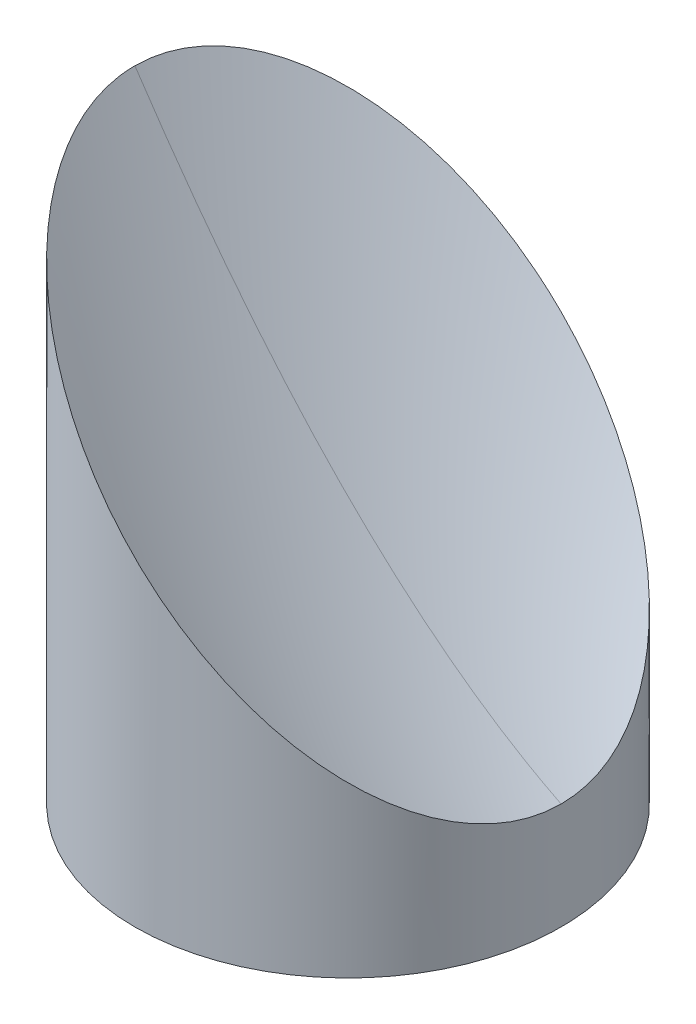
ISO-10303-21;
HEADER;
FILE_DESCRIPTION(('STEP AP214'),'2;1');
FILE_NAME('part.step','',(''),(''),'','','');
FILE_SCHEMA(('AUTOMOTIVE_DESIGN { 1 0 10303 214 1 1 1 1 }'));
ENDSEC;
DATA;
#1=APPLICATION_CONTEXT('core data for automotive mechanical design processes');
#2=APPLICATION_PROTOCOL_DEFINITION('international standard','automotive_design',2000,#1);
#3=PRODUCT_CONTEXT('',#1,'mechanical');
#4=PRODUCT('Part','Part','',(#3));
#5=PRODUCT_RELATED_PRODUCT_CATEGORY('part','',(#4));
#6=PRODUCT_DEFINITION_FORMATION('','',#4);
#7=PRODUCT_DEFINITION_CONTEXT('part definition',#1,'design');
#8=PRODUCT_DEFINITION('design','',#6,#7);
#9=PRODUCT_DEFINITION_SHAPE('','',#8);
#10=(LENGTH_UNIT() NAMED_UNIT(*) SI_UNIT(.MILLI.,.METRE.));
#11=(NAMED_UNIT(*) PLANE_ANGLE_UNIT() SI_UNIT($,.RADIAN.));
#12=(NAMED_UNIT(*) SI_UNIT($,.STERADIAN.) SOLID_ANGLE_UNIT());
#13=UNCERTAINTY_MEASURE_WITH_UNIT(LENGTH_MEASURE(1.E-05),#10,'distance_accuracy_value','');
#14=(GEOMETRIC_REPRESENTATION_CONTEXT(3) GLOBAL_UNCERTAINTY_ASSIGNED_CONTEXT((#13)) GLOBAL_UNIT_ASSIGNED_CONTEXT((#10,
#11,#12)) REPRESENTATION_CONTEXT('',''));
#15=CARTESIAN_POINT('',(0.,0.,0.));
#16=DIRECTION('',(0.,0.,1.));
#17=DIRECTION('',(1.,0.,0.));
#18=AXIS2_PLACEMENT_3D('',#15,#16,#17);
#19=CARTESIAN_POINT('',(9.525,4.32,0.));
#20=DIRECTION('',(0.,1.,0.));
#21=DIRECTION('',(0.,0.,1.));
#22=AXIS2_PLACEMENT_3D('',#19,#20,#21);
#23=PLANE('',#22);
#24=CARTESIAN_POINT('',(9.525,4.32,0.));
#25=DIRECTION('',(0.,-1.,0.));
#26=DIRECTION('',(0.,0.,-1.));
#27=AXIS2_PLACEMENT_3D('',#24,#25,#26);
#28=CIRCLE('',#27,1.594);
#29=CARTESIAN_POINT('',(9.525,4.32,-1.594));
#30=VERTEX_POINT('',#29);
#31=EDGE_CURVE('E19',#30,#30,#28,.T.);
#32=ORIENTED_EDGE('',*,*,#31,.T.);
#33=EDGE_LOOP('',(#32));
#34=FACE_BOUND('',#33,.T.);
#35=ADVANCED_FACE('F16',(#34),#23,.F.);
#36=CARTESIAN_POINT('',(0.,4.32,0.));
#37=DIRECTION('',(0.,1.,0.));
#38=DIRECTION('',(0.,0.,1.));
#39=AXIS2_PLACEMENT_3D('',#36,#37,#38);
#40=PLANE('',#39);
#41=CARTESIAN_POINT('',(0.,4.32,0.));
#42=DIRECTION('',(0.,-1.,0.));
#43=DIRECTION('',(0.,0.,-1.));
#44=AXIS2_PLACEMENT_3D('',#41,#42,#43);
#45=CIRCLE('',#44,1.594);
#46=CARTESIAN_POINT('',(0.,4.32,-1.594));
#47=VERTEX_POINT('',#46);
#48=EDGE_CURVE('E64',#47,#47,#45,.T.);
#49=ORIENTED_EDGE('',*,*,#48,.T.);
#50=EDGE_LOOP('',(#49));
#51=FACE_BOUND('',#50,.T.);
#52=ADVANCED_FACE('F128',(#51),#40,.F.);
#53=CARTESIAN_POINT('',(-9.525,6.1699999999405,0.));
#54=DIRECTION('',(0.,-1.,0.));
#55=DIRECTION('',(0.,0.,-1.));
#56=AXIS2_PLACEMENT_3D('',#53,#54,#55);
#57=CONICAL_SURFACE('',#56,1.35255000014922,1.02974425866422);
#58=CARTESIAN_POINT('',(-9.525,6.98269403028462,0.));
#59=VERTEX_POINT('',#58);
#60=VERTEX_LOOP('',#59);
#61=FACE_BOUND('',#60,.T.);
#62=CARTESIAN_POINT('',(-9.525,6.17,0.));
#63=DIRECTION('',(0.,-1.,0.));
#64=DIRECTION('',(0.,0.,-1.));
#65=AXIS2_PLACEMENT_3D('',#62,#63,#64);
#66=CIRCLE('',#65,1.35255);
#67=CARTESIAN_POINT('',(-9.525,6.17,-1.35255));
#68=VERTEX_POINT('',#67);
#69=EDGE_CURVE('E58',#68,#68,#66,.T.);
#70=ORIENTED_EDGE('',*,*,#69,.T.);
#71=EDGE_LOOP('',(#70));
#72=FACE_BOUND('',#71,.T.);
#73=ADVANCED_FACE('F125',(#61,#72),#57,.F.);
#74=CARTESIAN_POINT('',(4.76250000000001,6.17000000005419,8.24889197104677));
#75=DIRECTION('',(0.,-1.,0.));
#76=DIRECTION('',(0.,0.,-1.));
#77=AXIS2_PLACEMENT_3D('',#74,#75,#76);
#78=CONICAL_SURFACE('',#77,1.35254999986183,1.02974425844574);
#79=CARTESIAN_POINT('',(4.76250000000001,6.98269403039831,8.24889197113204));
#80=VERTEX_POINT('',#79);
#81=VERTEX_LOOP('',#80);
#82=FACE_BOUND('',#81,.T.);
#83=CARTESIAN_POINT('',(4.76250000000001,6.17,8.24889197104677));
#84=DIRECTION('',(0.,-1.,0.));
#85=DIRECTION('',(0.,0.,-1.));
#86=AXIS2_PLACEMENT_3D('',#83,#84,#85);
#87=CIRCLE('',#86,1.35255);
#88=CARTESIAN_POINT('',(4.76250000000001,6.17,6.89634197104677));
#89=VERTEX_POINT('',#88);
#90=EDGE_CURVE('E53',#89,#89,#87,.T.);
#91=ORIENTED_EDGE('',*,*,#90,.T.);
#92=EDGE_LOOP('',(#91));
#93=FACE_BOUND('',#92,.T.);
#94=ADVANCED_FACE('F47',(#82,#93),#78,.F.);
#95=CARTESIAN_POINT('',(4.76250000000001,6.16999999999734,-8.24889197104677));
#96=DIRECTION('',(0.,-1.,0.));
#97=DIRECTION('',(1.,0.,0.));
#98=AXIS2_PLACEMENT_3D('',#95,#96,#97);
#99=CONICAL_SURFACE('',#98,1.35254999992502,1.02974425866409);
#100=CARTESIAN_POINT('',(4.76250000000001,6.98269403019935,-8.24889197110362));
#101=VERTEX_POINT('',#100);
#102=VERTEX_LOOP('',#101);
#103=FACE_BOUND('',#102,.T.);
#104=CARTESIAN_POINT('',(4.76250000000001,6.17,-8.24889197104677));
#105=DIRECTION('',(0.,-1.,0.));
#106=DIRECTION('',(0.,0.,-1.));
#107=AXIS2_PLACEMENT_3D('',#104,#105,#106);
#108=CIRCLE('',#107,1.35255);
#109=CARTESIAN_POINT('',(4.76250000000001,6.17,-9.60144197104677));
#110=VERTEX_POINT('',#109);
#111=EDGE_CURVE('E51',#110,#110,#108,.T.);
#112=ORIENTED_EDGE('',*,*,#111,.T.);
#113=EDGE_LOOP('',(#112));
#114=FACE_BOUND('',#113,.T.);
#115=ADVANCED_FACE('F43',(#103,#114),#99,.F.);
#116=CARTESIAN_POINT('',(9.525,0.,0.));
#117=DIRECTION('',(0.,-1.,0.));
#118=DIRECTION('',(0.,0.,-1.));
#119=AXIS2_PLACEMENT_3D('',#116,#117,#118);
#120=CYLINDRICAL_SURFACE('',#119,1.594);
#121=ORIENTED_EDGE('',*,*,#31,.F.);
#122=EDGE_LOOP('',(#121));
#123=FACE_BOUND('',#122,.T.);
#124=CARTESIAN_POINT('',(9.525,0.,0.));
#125=DIRECTION('',(0.,-1.,0.));
#126=DIRECTION('',(0.,0.,-1.));
#127=AXIS2_PLACEMENT_3D('',#124,#125,#126);
#128=CIRCLE('',#127,1.594);
#129=CARTESIAN_POINT('',(9.525,0.,-1.594));
#130=VERTEX_POINT('',#129);
#131=EDGE_CURVE('E55',#130,#130,#128,.T.);
#132=ORIENTED_EDGE('',*,*,#131,.T.);
#133=EDGE_LOOP('',(#132));
#134=FACE_BOUND('',#133,.T.);
#135=ADVANCED_FACE('F46',(#123,#134),#120,.F.);
#136=CARTESIAN_POINT('',(0.,0.,0.));
#137=DIRECTION('',(0.,-1.,0.));
#138=DIRECTION('',(0.,0.,-1.));
#139=AXIS2_PLACEMENT_3D('',#136,#137,#138);
#140=CYLINDRICAL_SURFACE('',#139,1.594);
#141=ORIENTED_EDGE('',*,*,#48,.F.);
#142=EDGE_LOOP('',(#141));
#143=FACE_BOUND('',#142,.T.);
#144=CARTESIAN_POINT('',(0.,0.,0.));
#145=DIRECTION('',(0.,-1.,0.));
#146=DIRECTION('',(0.,0.,-1.));
#147=AXIS2_PLACEMENT_3D('',#144,#145,#146);
#148=CIRCLE('',#147,1.594);
#149=CARTESIAN_POINT('',(0.,0.,-1.594));
#150=VERTEX_POINT('',#149);
#151=EDGE_CURVE('E163',#150,#150,#148,.T.);
#152=ORIENTED_EDGE('',*,*,#151,.T.);
#153=EDGE_LOOP('',(#152));
#154=FACE_BOUND('',#153,.T.);
#155=ADVANCED_FACE('F115',(#143,#154),#140,.F.);
#156=CARTESIAN_POINT('',(-9.525,0.,0.));
#157=DIRECTION('',(0.,-1.,0.));
#158=DIRECTION('',(0.,0.,-1.));
#159=AXIS2_PLACEMENT_3D('',#156,#157,#158);
#160=CYLINDRICAL_SURFACE('',#159,1.35255);
#161=ORIENTED_EDGE('',*,*,#69,.F.);
#162=EDGE_LOOP('',(#161));
#163=FACE_BOUND('',#162,.T.);
#164=CARTESIAN_POINT('',(-9.525,0.,0.));
#165=DIRECTION('',(0.,-1.,0.));
#166=DIRECTION('',(0.,0.,-1.));
#167=AXIS2_PLACEMENT_3D('',#164,#165,#166);
#168=CIRCLE('',#167,1.35255);
#169=CARTESIAN_POINT('',(-9.525,0.,-1.35255));
#170=VERTEX_POINT('',#169);
#171=EDGE_CURVE('E159',#170,#170,#168,.T.);
#172=ORIENTED_EDGE('',*,*,#171,.T.);
#173=EDGE_LOOP('',(#172));
#174=FACE_BOUND('',#173,.T.);
#175=ADVANCED_FACE('F111',(#163,#174),#160,.F.);
#176=CARTESIAN_POINT('',(4.76250000000001,0.,8.24889197104677));
#177=DIRECTION('',(0.,-1.,0.));
#178=DIRECTION('',(0.,0.,-1.));
#179=AXIS2_PLACEMENT_3D('',#176,#177,#178);
#180=CYLINDRICAL_SURFACE('',#179,1.35255);
#181=ORIENTED_EDGE('',*,*,#90,.F.);
#182=EDGE_LOOP('',(#181));
#183=FACE_BOUND('',#182,.T.);
#184=CARTESIAN_POINT('',(4.76250000000001,0.,8.24889197104677));
#185=DIRECTION('',(0.,-1.,0.));
#186=DIRECTION('',(0.,0.,-1.));
#187=AXIS2_PLACEMENT_3D('',#184,#185,#186);
#188=CIRCLE('',#187,1.35255);
#189=CARTESIAN_POINT('',(4.76250000000001,0.,6.89634197104677));
#190=VERTEX_POINT('',#189);
#191=EDGE_CURVE('E155',#190,#190,#188,.T.);
#192=ORIENTED_EDGE('',*,*,#191,.T.);
#193=EDGE_LOOP('',(#192));
#194=FACE_BOUND('',#193,.T.);
#195=ADVANCED_FACE('F108',(#183,#194),#180,.F.);
#196=CARTESIAN_POINT('',(4.76250000000001,0.,-8.24889197104677));
#197=DIRECTION('',(0.,-1.,0.));
#198=DIRECTION('',(0.,0.,-1.));
#199=AXIS2_PLACEMENT_3D('',#196,#197,#198);
#200=CYLINDRICAL_SURFACE('',#199,1.35255);
#201=ORIENTED_EDGE('',*,*,#111,.F.);
#202=EDGE_LOOP('',(#201));
#203=FACE_BOUND('',#202,.T.);
#204=CARTESIAN_POINT('',(4.76250000000001,0.,-8.24889197104677));
#205=DIRECTION('',(0.,-1.,0.));
#206=DIRECTION('',(0.,0.,-1.));
#207=AXIS2_PLACEMENT_3D('',#204,#205,#206);
#208=CIRCLE('',#207,1.35255);
#209=CARTESIAN_POINT('',(4.76250000000001,0.,-9.60144197104677));
#210=VERTEX_POINT('',#209);
#211=EDGE_CURVE('E151',#210,#210,#208,.T.);
#212=ORIENTED_EDGE('',*,*,#211,.T.);
#213=EDGE_LOOP('',(#212));
#214=FACE_BOUND('',#213,.T.);
#215=ADVANCED_FACE('F100',(#203,#214),#200,.F.);
#216=CARTESIAN_POINT('',(-7.35545940849888,31.9790571999952,19.7583418836589));
#217=CARTESIAN_POINT('',(-7.3992268019521,31.9790571999952,19.684669160883));
#218=CARTESIAN_POINT('',(-7.44299419540531,31.9790571999952,19.6109964381072));
#219=CARTESIAN_POINT('',(-7.48676158885853,31.9790571999952,19.5373237153313));
#220=CARTESIAN_POINT('',(-11.0202427225006,31.9790571999952,13.5894900553082));
#221=CARTESIAN_POINT('',(-12.8524000000013,31.9790571999952,6.91825224815346));
#222=CARTESIAN_POINT('',(-12.8524000000009,31.9790571999952,-2.07993344769619E-12));
#223=CARTESIAN_POINT('',(3.65002695318783,12.6233427999981,13.1197489267324));
#224=CARTESIAN_POINT('',(3.62096493894266,12.6233427999981,13.0708294560977));
#225=CARTESIAN_POINT('',(3.5919029246975,12.6233427999981,13.021909985463));
#226=CARTESIAN_POINT('',(3.56284091045234,12.6233427999981,12.9729905148283));
#227=CARTESIAN_POINT('',(1.21657189740978,12.6233427999981,9.02356577377702));
#228=CARTESIAN_POINT('',(-1.02731684841556E-12,12.6233427999981,4.59379299346177));
#229=CARTESIAN_POINT('',(-7.68482499857726E-13,12.6233427999981,-1.43114686768087E-12));
#230=CARTESIAN_POINT('',(14.6555133148746,6.27425719999851,6.48115596980584));
#231=CARTESIAN_POINT('',(14.6411566798374,6.27425719999851,6.4569897513123));
#232=CARTESIAN_POINT('',(14.6268000448003,6.27425719999851,6.43282353281876));
#233=CARTESIAN_POINT('',(14.6124434097632,6.27425719999851,6.40865731432522));
#234=CARTESIAN_POINT('',(13.4533865173202,6.27425719999851,4.45764149224585));
#235=CARTESIAN_POINT('',(12.8523999999993,6.27425719999851,2.26933373877008));
#236=CARTESIAN_POINT('',(12.8523999999994,6.27425719999851,-7.8236028766554E-13));
#237=(BOUNDED_SURFACE() B_SPLINE_SURFACE(2,3,((#216,#217,#218,#219,#220,#221,#222),(#223,#224,
#225,#226,#227,#228,#229),(#230,#231,#232,#233,#234,#235,#236)),.UNSPECIFIED.,.F.,.F.,
.F.) B_SPLINE_SURFACE_WITH_KNOTS((3,3),(4,3,4),(0.497316529430011,0.499119764633748),
(-0.0126885066234293,0.,1.),
.UNSPECIFIED.) GEOMETRIC_REPRESENTATION_ITEM() RATIONAL_B_SPLINE_SURFACE(((1.,1.,1.,1.,
0.976196835834583,0.976196835834583,1.),(1.,1.,1.,1.,0.976196835834583,0.976196835834583,1.),
(1.,1.,1.,1.,0.976196835834583,0.976196835834583,1.))) REPRESENTATION_ITEM('') SURFACE());
#238=CARTESIAN_POINT('',(12.7000000000005,6.34999999999805,-1.49290162293995E-13));
#239=CARTESIAN_POINT('',(12.7000017011149,6.34999829886429,0.135684319533247));
#240=CARTESIAN_POINT('',(12.6978249686512,6.35217503132529,0.271349485590047));
#241=CARTESIAN_POINT('',(12.6891366451333,6.36086335485004,0.542394958706766));
#242=CARTESIAN_POINT('',(12.68262528079,6.36737471920297,0.677775280293213));
#243=CARTESIAN_POINT('',(12.6566372266847,6.39336277332404,1.0829016605392));
#244=CARTESIAN_POINT('',(12.6307064947281,6.41929350527379,1.35187379328139));
#245=CARTESIAN_POINT('',(12.5623957304709,6.48760426952366,1.88349381226342));
#246=CARTESIAN_POINT('',(12.5201386475947,6.52986135239921,2.14617374177845));
#247=CARTESIAN_POINT('',(12.4199443961495,6.63005560385286,2.66550556702404));
#248=CARTESIAN_POINT('',(12.3620053417707,6.68799465824072,2.92215673373902));
#249=CARTESIAN_POINT('',(12.2316136459698,6.81838635401521,3.42716649720932));
#250=CARTESIAN_POINT('',(12.1592002672148,6.89079973273475,3.67554545140015));
#251=CARTESIAN_POINT('',(12.0008408041062,7.04915919584606,4.16361365220012));
#252=CARTESIAN_POINT('',(11.9148891545333,7.13511084545715,4.40329927514461));
#253=CARTESIAN_POINT('',(11.7305003051679,7.31949969483784,4.87331419403931));
#254=CARTESIAN_POINT('',(11.6320443778897,7.41795562209308,5.10362875747057));
#255=CARTESIAN_POINT('',(11.4239093497657,7.62609065020948,5.55390368304366));
#256=CARTESIAN_POINT('',(11.3142277619276,7.735772238063,5.77386173492126));
#257=CARTESIAN_POINT('',(11.0342510430316,8.01574895697619,6.29746576760011));
#258=CARTESIAN_POINT('',(10.8585266090104,8.19147339099021,6.59533128150528));
#259=CARTESIAN_POINT('',(10.4892616079395,8.56073839205579,7.16809628243282));
#260=CARTESIAN_POINT('',(10.2957146646943,8.7542853353029,7.44298748252609));
#261=CARTESIAN_POINT('',(9.89325545716092,9.15674454283758,7.97017201462035));
#262=CARTESIAN_POINT('',(9.68431845608118,9.36568154391676,8.22242745386866));
#263=CARTESIAN_POINT('',(9.2537642200505,9.79623577994703,8.70415000741117));
#264=CARTESIAN_POINT('',(9.03214676471713,10.0178532352805,8.9336167254546));
#265=CARTESIAN_POINT('',(8.49068987778179,10.559310122216,9.45455770225872));
#266=CARTESIAN_POINT('',(8.1659262215024,10.8840737784952,9.73582571164182));
#267=CARTESIAN_POINT('',(7.50032715987935,11.549672840118,10.25738576244));
#268=CARTESIAN_POINT('',(7.1594856086855,11.8905143913119,10.497661969845));
#269=CARTESIAN_POINT('',(6.46518056264576,12.5848194373515,10.9389532419108));
#270=CARTESIAN_POINT('',(6.11171110168088,12.9382888983163,11.1399494504586));
#271=CARTESIAN_POINT('',(5.39523454203173,13.6547654579653,11.5040387573052));
#272=CARTESIAN_POINT('',(5.03222836458575,14.0177716354112,11.6671355017827));
#273=CARTESIAN_POINT('',(4.28669922301028,14.7633007769866,11.9616131681878));
#274=CARTESIAN_POINT('',(3.90393028814002,15.1460697118568,12.0917445377847));
#275=CARTESIAN_POINT('',(3.13294073118961,15.9170592688071,12.3140426090655));
#276=CARTESIAN_POINT('',(2.74471999432905,16.3052800056676,12.4062085101941));
#277=CARTESIAN_POINT('',(1.96461579671985,17.0853842032766,12.5534019921634));
#278=CARTESIAN_POINT('',(1.57273084383968,17.4772691561567,12.6084137100646));
#279=CARTESIAN_POINT('',(0.787240611477834,18.2627593885185,12.6817135085008));
#280=CARTESIAN_POINT('',(0.393635201152761,18.6563647988435,12.6999987454599));
#281=CARTESIAN_POINT('',(-0.488910704347572,19.5389107043436,12.7000015581892));
#282=CARTESIAN_POINT('',(-0.977867365914178,20.0278673659102,12.671797082081));
#283=CARTESIAN_POINT('',(-1.95261147372935,21.0026114737252,12.558587254873));
#284=CARTESIAN_POINT('',(-2.43839806162282,21.4883980616185,12.4735671157963));
#285=CARTESIAN_POINT('',(-3.40301609318628,22.4530160931818,12.2456133050654));
#286=CARTESIAN_POINT('',(-3.88184960107106,22.9318496010665,12.1026972012504));
#287=CARTESIAN_POINT('',(-4.82852880758293,23.8785288075782,11.757087123796));
#288=CARTESIAN_POINT('',(-5.29637916796017,24.3463791679554,11.5544190256716));
#289=CARTESIAN_POINT('',(-6.07820209929305,25.1282020992881,11.1568751475988));
#290=CARTESIAN_POINT('',(-6.39624295531956,25.4462429553145,10.9778914974724));
#291=CARTESIAN_POINT('',(-7.02251406230757,26.0725140623025,10.588215246733));
#292=CARTESIAN_POINT('',(-7.33074470835761,26.3807447083525,10.3775239250518));
#293=CARTESIAN_POINT('',(-7.93448131570479,26.9844813156995,9.92353207291582));
#294=CARTESIAN_POINT('',(-8.23000339457594,27.2800033945706,9.68027455862783));
#295=CARTESIAN_POINT('',(-8.80567016333666,27.8556701633312,9.15973145154289));
#296=CARTESIAN_POINT('',(-9.08581930747837,28.135819307473,8.88245579153209));
#297=CARTESIAN_POINT('',(-9.55687233925018,28.6068723392446,8.36923408012617));
#298=CARTESIAN_POINT('',(-9.75209276753756,28.8020927675317,8.14119328335239));
#299=CARTESIAN_POINT('',(-10.1302585965146,29.1802585965091,7.66551745096178));
#300=CARTESIAN_POINT('',(-10.3132045823527,29.3632045823477,7.41788335062723));
#301=CARTESIAN_POINT('',(-10.664590769056,29.7145907690494,6.90315370176919));
#302=CARTESIAN_POINT('',(-10.8330427331003,29.8830427330916,6.63607426618261));
#303=CARTESIAN_POINT('',(-11.1532332972229,30.2032332972199,6.08256034394952));
#304=CARTESIAN_POINT('',(-11.3049757465883,30.3549757465931,5.79613033963114));
#305=CARTESIAN_POINT('',(-11.5604367059008,30.6104367058862,5.26448896252812));
#306=CARTESIAN_POINT('',(-11.6676635062442,30.7176635062092,5.02264366231888));
#307=CARTESIAN_POINT('',(-11.8684313393862,30.9184313393517,4.52786624209307));
#308=CARTESIAN_POINT('',(-11.9619755017775,31.0119755017639,4.27493667460569));
#309=CARTESIAN_POINT('',(-12.133839217127,31.1838392171286,3.75947140967091));
#310=CARTESIAN_POINT('',(-12.2121860834141,31.2621860834101,3.4969539726506));
#311=CARTESIAN_POINT('',(-12.3525206131938,31.4025206131856,2.96332349314077));
#312=CARTESIAN_POINT('',(-12.4145121818282,31.4645121818216,2.69221251987207));
#313=CARTESIAN_POINT('',(-12.5058242477378,31.5558242477319,2.22135360234751));
#314=CARTESIAN_POINT('',(-12.5394220647067,31.5894220647006,2.02324625351956));
#315=CARTESIAN_POINT('',(-12.5973040144465,31.6473040144403,1.62435597620623));
#316=CARTESIAN_POINT('',(-12.6215901722819,31.6715901722757,1.42357363930663));
#317=CARTESIAN_POINT('',(-12.6606434397059,31.7106434396998,1.01951125329298));
#318=CARTESIAN_POINT('',(-12.6753799408529,31.7253799408468,0.81622528021918));
#319=CARTESIAN_POINT('',(-12.695069988141,31.7450699881348,0.408630021819979));
#320=CARTESIAN_POINT('',(-12.7000197234394,31.7500197234332,0.204320368918747));
#321=CARTESIAN_POINT('',(-12.7000000000005,31.7499999999942,-1.30377251613223E-12));
#322=B_SPLINE_CURVE_WITH_KNOTS('',3,(#238,#239,#240,#241,#242,#243,#244,#245,#246,#247,#248,
#249,#250,#251,#252,#253,#254,#255,#256,#257,#258,#259,#260,#261,#262,#263,#264,#265,#266,#267,
#268,#269,#270,#271,#272,#273,#274,#275,#276,#277,#278,#279,#280,#281,#282,#283,#284,#285,#286,
#287,#288,#289,#290,#291,#292,#293,#294,#295,#296,#297,#298,#299,#300,#301,#302,#303,#304,#305,
#306,#307,#308,#309,#310,#311,#312,#313,#314,#315,#316,#317,#318,#319,#320,#321),.UNSPECIFIED.,
.F.,.F.,(4,2,2,2,2,2,2,2,2,2,2,2,2,2,2,2,2,2,2,2,2,2,2,2,2,2,2,2,2,2,2,2,2,2,2,2,2,2,2,2,2,4),
(0.,0.406980210457048,0.813939136623312,1.62713767846873,2.43432798926607,3.24161541056928,
4.0467420183759,4.85220046003129,5.65887977444556,6.46573819332346,7.62775582413327,
8.7901908065715,9.95453677767304,11.1189029909033,12.7322240660941,14.3461669189255,
15.9608826418055,17.5754429539951,19.2442438284376,20.9130798900879,22.5826280098854,
24.2523053907365,26.3261116508495,28.4004578914593,30.4741751673837,32.5469957387718,
33.998157829999,35.4492614041471,36.8984668097703,38.3472500718218,39.4206612057517,
40.4940211315017,41.5665015482532,42.6387343839202,43.4943078928193,44.3496854016644,
45.2035110428909,46.057132631942,46.667903129338,47.2785407232307,47.8911259694882,
48.5039497017491),.UNSPECIFIED.);
#323=CARTESIAN_POINT('',(12.6999999999999,6.34999999999825,0.));
#324=VERTEX_POINT('',#323);
#325=CARTESIAN_POINT('',(-12.7000000000004,31.7499999999942,-5.6884113854803E-13));
#326=VERTEX_POINT('',#325);
#327=EDGE_CURVE('E73',#324,#326,#322,.T.);
#328=CARTESIAN_POINT('',(-12.852400000001,31.9790571999952,0.));
#329=CARTESIAN_POINT('',(-8.48279779752659E-13,12.6233427999981,0.));
#330=CARTESIAN_POINT('',(12.8523999999993,6.27425719999851,0.));
#331=B_SPLINE_CURVE_WITH_KNOTS('',2,(#328,#329,#330),.UNSPECIFIED.,.F.,.F.,(3,3),
(0.497316529430011,0.499119764633748),.UNSPECIFIED.);
#332=EDGE_CURVE('E31',#326,#324,#331,.T.);
#333=ORIENTED_EDGE('',*,*,#327,.F.);
#334=ORIENTED_EDGE('',*,*,#332,.F.);
#335=EDGE_LOOP('',(#333,#334));
#336=FACE_BOUND('',#335,.T.);
#337=ADVANCED_FACE('F88',(#336),#237,.T.);
#338=CARTESIAN_POINT('',(-12.852400000001,31.9790571999952,0.));
#339=CARTESIAN_POINT('',(-12.852400000001,31.9790571999952,-6.85137267380552));
#340=CARTESIAN_POINT('',(-11.0546763918248,31.9790571999952,-13.4626885295165));
#341=CARTESIAN_POINT('',(-7.58520562712344,31.9790571999952,-19.3706560419739));
#342=CARTESIAN_POINT('',(-7.54008792692553,31.9790571999952,-19.4474844475388));
#343=CARTESIAN_POINT('',(-7.49497022672763,31.9790571999952,-19.5243128531037));
#344=CARTESIAN_POINT('',(-7.44985252652973,31.9790571999952,-19.6011412586686));
#345=CARTESIAN_POINT('',(-8.48279779752659E-13,12.6233427999981,0.));
#346=CARTESIAN_POINT('',(-8.52320444662484E-13,12.6233427999981,-4.54938424555483));
#347=CARTESIAN_POINT('',(1.19370757514934,12.6233427999981,-8.93936821349044));
#348=CARTESIAN_POINT('',(3.49747302315824,12.6233427999981,-12.8623214090133));
#349=CARTESIAN_POINT('',(3.52743165542776,12.6233427999981,-12.9133362865464));
#350=CARTESIAN_POINT('',(3.55739028769729,12.6233427999981,-12.9643511640796));
#351=CARTESIAN_POINT('',(3.58734891996681,12.6233427999981,-13.0153660416127));
#352=CARTESIAN_POINT('',(12.8523999999993,6.27425719999851,0.));
#353=CARTESIAN_POINT('',(12.8523999999993,6.27425719999851,-2.24739581730413));
#354=CARTESIAN_POINT('',(13.4420915421235,6.27425719999851,-4.41604789746437));
#355=CARTESIAN_POINT('',(14.5801516734399,6.27425719999851,-6.3539867760527));
#356=CARTESIAN_POINT('',(14.5949512377811,6.27425719999851,-6.37918812555406));
#357=CARTESIAN_POINT('',(14.6097508021222,6.27425719999851,-6.40438947505543));
#358=CARTESIAN_POINT('',(14.6245503664634,6.27425719999851,-6.42959082455679));
#359=(BOUNDED_SURFACE() B_SPLINE_SURFACE(2,3,((#338,#339,#340,#341,#342,#343,#344),(#345,#346,
#347,#348,#349,#350,#351),(#352,#353,#354,#355,#356,#357,#358)),.UNSPECIFIED.,.F.,.F.,
.F.) B_SPLINE_SURFACE_WITH_KNOTS((3,3),(4,3,4),(0.497316529430011,0.499119764633748),(0.,1.,
1.01331522633352),.UNSPECIFIED.) GEOMETRIC_REPRESENTATION_ITEM() RATIONAL_B_SPLINE_SURFACE(((1.,
0.976641486845172,0.976641486845172,1.,1.,1.,1.),(1.,0.976641486845172,0.976641486845172,1.,1.,
1.,1.),(1.,0.976641486845172,0.976641486845172,1.,1.,1.,1.))) REPRESENTATION_ITEM('') SURFACE());
#360=CARTESIAN_POINT('',(-12.7000000000005,31.7499999999942,-1.17152187488664E-12));
#361=CARTESIAN_POINT('',(-12.7000020707157,31.750002070697,-0.142407966170142));
#362=CARTESIAN_POINT('',(-12.6976040042996,31.7476040042792,-0.284793781600676));
#363=CARTESIAN_POINT('',(-12.6880342807367,31.7380342807208,-0.569237167349131));
#364=CARTESIAN_POINT('',(-12.680862865841,31.7308628658314,-0.711294753957798));
#365=CARTESIAN_POINT('',(-12.6522480771236,31.702248077124,-1.13627656489728));
#366=CARTESIAN_POINT('',(-12.6237040430106,31.6737040430061,-1.4183067520983));
#367=CARTESIAN_POINT('',(-12.5486147844179,31.5986147844098,-1.97497626476649));
#368=CARTESIAN_POINT('',(-12.5022246147071,31.5522246147003,-2.24965803339746));
#369=CARTESIAN_POINT('',(-12.3923608421438,31.4423608421381,-2.79212884540757));
#370=CARTESIAN_POINT('',(-12.3288847952931,31.3788847952872,-3.05991689668675));
#371=CARTESIAN_POINT('',(-12.1862353098729,31.2362353098667,-3.58605081036923));
#372=CARTESIAN_POINT('',(-12.1071087717128,31.1571087717062,-3.84442221671401));
#373=CARTESIAN_POINT('',(-11.9343428331518,30.984342833146,-4.35122325696649));
#374=CARTESIAN_POINT('',(-11.8407039347571,30.8907039347523,-4.59965323439057));
#375=CARTESIAN_POINT('',(-11.6400731605229,30.6900731605155,-5.08606342751127));
#376=CARTESIAN_POINT('',(-11.5330571078636,30.5830571078527,-5.3240236406245));
#377=CARTESIAN_POINT('',(-11.3070954591728,30.3570954591642,-5.78846621347239));
#378=CARTESIAN_POINT('',(-11.1881433915298,30.2381433915271,-6.01494224531156));
#379=CARTESIAN_POINT('',(-10.8889412677954,29.9389412677847,-6.54582856159141));
#380=CARTESIAN_POINT('',(-10.7034696633878,29.7534696633541,-6.84437539165021));
#381=CARTESIAN_POINT('',(-10.3147078578381,29.3647078578029,-7.41732905638671));
#382=CARTESIAN_POINT('',(-10.1114102147448,29.1614102147311,-7.69172571222706));
#383=CARTESIAN_POINT('',(-9.68954881388517,28.7395488138873,-8.21682613202672));
#384=CARTESIAN_POINT('',(-9.47096222661665,28.5209622266131,-8.46749309021955));
#385=CARTESIAN_POINT('',(-9.0212519489643,28.0712519489566,-8.94508899530427));
#386=CARTESIAN_POINT('',(-8.79012803565234,27.8401280356461,-9.17201751988917));
#387=CARTESIAN_POINT('',(-8.22599944537793,27.2759994453734,-9.68604956058552));
#388=CARTESIAN_POINT('',(-7.88813662106952,26.9381366210644,-9.9625221886943));
#389=CARTESIAN_POINT('',(-7.19668929676739,26.2466892967619,-10.4729378522536));
#390=CARTESIAN_POINT('',(-6.84309864562786,25.8930986456226,-10.7068640625304));
#391=CARTESIAN_POINT('',(-6.12375993154385,25.1737599315388,-11.1339367158252));
#392=CARTESIAN_POINT('',(-5.75800879092412,24.8080087909191,-11.3270727429903));
#393=CARTESIAN_POINT('',(-5.01740027547806,24.0674002754732,-11.6740263493308));
#394=CARTESIAN_POINT('',(-4.64254421213435,23.6925442121298,-11.8278495548182));
#395=CARTESIAN_POINT('',(-3.91632884067469,22.9663288406699,-12.0867218179535));
#396=CARTESIAN_POINT('',(-3.56548506918433,22.6154850691791,-12.1946858164646));
#397=CARTESIAN_POINT('',(-2.85972611051897,21.9097261105152,-12.3792162199812));
#398=CARTESIAN_POINT('',(-2.50481116921999,21.554811169218,-12.4557845109563));
#399=CARTESIAN_POINT('',(-1.79223994422303,20.8422399442164,-12.5780995611691));
#400=CARTESIAN_POINT('',(-1.43458291273165,20.4845829127187,-12.6238375866991));
#401=CARTESIAN_POINT('',(-0.717961915995298,19.7679619159822,-12.684788428187));
#402=CARTESIAN_POINT('',(-0.358997839822599,19.4089978398159,-12.6999985897835));
#403=CARTESIAN_POINT('',(0.488809009679936,18.56119099032,-12.7000019201413));
#404=CARTESIAN_POINT('',(0.97768061500449,18.0723193849928,-12.671807788845));
#405=CARTESIAN_POINT('',(1.95226940284077,17.0977305971546,-12.5586379647045));
#406=CARTESIAN_POINT('',(2.4379855766558,16.6120144233404,-12.4736449376866));
#407=CARTESIAN_POINT('',(3.4026203218263,15.6473796781706,-12.2457264689484));
#408=CARTESIAN_POINT('',(3.88153881496644,15.1684611850304,-12.1028003611982));
#409=CARTESIAN_POINT('',(4.82837901882259,14.2216209811743,-11.757152098727));
#410=CARTESIAN_POINT('',(5.29630551375893,13.7536944862381,-11.5544564992998));
#411=CARTESIAN_POINT('',(6.07821250122414,12.971787498773,-11.1568698432024));
#412=CARTESIAN_POINT('',(6.39626354357574,12.6537364564214,-10.9778799077063));
#413=CARTESIAN_POINT('',(7.02255502287376,12.0274449771235,-10.5881885397701));
#414=CARTESIAN_POINT('',(7.33079583244299,11.7192041675544,-10.37748831353));
#415=CARTESIAN_POINT('',(7.93453120943443,11.115468790563,-9.92349172504452));
#416=CARTESIAN_POINT('',(8.23004273123933,10.8199572687581,-9.68024061170057));
#417=CARTESIAN_POINT('',(8.80568912739427,10.2443108726034,-9.15971268112502));
#418=CARTESIAN_POINT('',(9.08582846425632,9.9641715357415,-8.8824458150325));
#419=CARTESIAN_POINT('',(9.55687106400246,9.49312893599512,-8.3692354695402));
#420=CARTESIAN_POINT('',(9.75209028541235,9.29790971458495,-8.14119618260286));
#421=CARTESIAN_POINT('',(10.1302538959287,8.91974610406952,-7.66552358642559));
#422=CARTESIAN_POINT('',(10.3131988683074,8.73680113169201,-7.41789120946961));
#423=CARTESIAN_POINT('',(10.664585432399,8.38541456759733,-6.90316203017766));
#424=CARTESIAN_POINT('',(10.8330386078837,8.21696139210834,-6.63608109506673));
#425=CARTESIAN_POINT('',(11.1532313947672,7.89676860523669,-6.08256393489444));
#426=CARTESIAN_POINT('',(11.304974856052,7.74502514396795,-5.79613219286372));
#427=CARTESIAN_POINT('',(11.5604368362755,7.48956316370567,-5.2644886912604));
#428=CARTESIAN_POINT('',(11.6676637526403,7.38233624729964,-5.02264310661541));
#429=CARTESIAN_POINT('',(11.8684317846606,7.18156821528015,-4.52786509325692));
#430=CARTESIAN_POINT('',(11.9619760299594,7.08802397002333,-4.27493521711354));
#431=CARTESIAN_POINT('',(12.1338396761612,6.91616032385224,-3.75946990646228));
#432=CARTESIAN_POINT('',(12.2121864249001,6.83781357510221,-3.49695275544085));
#433=CARTESIAN_POINT('',(12.3525207557578,6.69747924423609,-2.96332286978742));
#434=CARTESIAN_POINT('',(12.4145122430185,6.6354877569782,-2.69221220437557));
#435=CARTESIAN_POINT('',(12.5058242340561,6.54417576594228,-2.22135367286374));
#436=CARTESIAN_POINT('',(12.539422040584,6.51057795941416,-2.02324639574572));
#437=CARTESIAN_POINT('',(12.5973039762652,6.45269602373286,-1.62435626333522));
#438=CARTESIAN_POINT('',(12.6215901304713,6.4284098695268,-1.42357399962518));
#439=CARTESIAN_POINT('',(12.6606434116319,6.38935658836626,-1.01951161620149));
#440=CARTESIAN_POINT('',(12.6753799232757,6.37462007672243,-0.816225571196216));
#441=CARTESIAN_POINT('',(12.6950699846204,6.35493001537778,-0.408630167842066));
#442=CARTESIAN_POINT('',(12.7000197234731,6.34998027652518,-0.204320441916699));
#443=CARTESIAN_POINT('',(12.7000000000004,6.34999999999805,0.));
#444=B_SPLINE_CURVE_WITH_KNOTS('',3,(#360,#361,#362,#363,#364,#365,#366,#367,#368,#369,#370,
#371,#372,#373,#374,#375,#376,#377,#378,#379,#380,#381,#382,#383,#384,#385,#386,#387,#388,#389,
#390,#391,#392,#393,#394,#395,#396,#397,#398,#399,#400,#401,#402,#403,#404,#405,#406,#407,#408,
#409,#410,#411,#412,#413,#414,#415,#416,#417,#418,#419,#420,#421,#422,#423,#424,#425,#426,#427,
#428,#429,#430,#431,#432,#433,#434,#435,#436,#437,#438,#439,#440,#441,#442,#443),.UNSPECIFIED.,
.F.,.F.,(4,2,2,2,2,2,2,2,2,2,2,2,2,2,2,2,2,2,2,2,2,2,2,2,2,2,2,2,2,2,2,2,2,2,2,2,2,2,2,2,2,4),
(0.,0.427139825292229,0.854257974559347,1.70760715655727,2.55370368550816,3.39992130618298,
4.24364044178663,5.08733039828143,5.93256783901612,6.77826606272049,7.96869652476862,
9.15962635145382,10.352374092093,11.5451430481195,13.198807769774,14.8531250254851,
16.5078642049504,18.1623664312065,19.6846810872613,21.2069042830452,22.7295585186315,
24.2523451414543,26.3257610189072,28.3998099610363,30.4738827482273,32.5470354198939,
33.9982444749617,35.4493983427022,36.8985555240436,38.3472897680928,39.4206940818285,
40.4940473512162,41.5665345237551,42.6387740780123,43.4943485693354,44.3497270576777,
45.2035517181621,46.0571723262589,46.6679426044969,47.2785799799419,47.8911654448648,
48.5039893960485),.UNSPECIFIED.);
#445=EDGE_CURVE('E25',#326,#324,#444,.T.);
#446=ORIENTED_EDGE('',*,*,#332,.T.);
#447=ORIENTED_EDGE('',*,*,#445,.F.);
#448=EDGE_LOOP('',(#446,#447));
#449=FACE_BOUND('',#448,.T.);
#450=ADVANCED_FACE('F82',(#449),#359,.T.);
#451=CARTESIAN_POINT('',(0.,0.,0.));
#452=DIRECTION('',(0.,1.,0.));
#453=DIRECTION('',(0.,0.,1.));
#454=AXIS2_PLACEMENT_3D('',#451,#452,#453);
#455=PLANE('',#454);
#456=CARTESIAN_POINT('',(0.,0.,0.));
#457=DIRECTION('',(0.,-1.,0.));
#458=DIRECTION('',(0.,0.,-1.));
#459=AXIS2_PLACEMENT_3D('',#456,#457,#458);
#460=CIRCLE('',#459,12.7);
#461=CARTESIAN_POINT('',(0.,0.,-12.7));
#462=VERTEX_POINT('',#461);
#463=EDGE_CURVE('E9',#462,#462,#460,.F.);
#464=ORIENTED_EDGE('',*,*,#463,.F.);
#465=EDGE_LOOP('',(#464));
#466=FACE_BOUND('',#465,.T.);
#467=ORIENTED_EDGE('',*,*,#211,.F.);
#468=EDGE_LOOP('',(#467));
#469=FACE_BOUND('',#468,.T.);
#470=ORIENTED_EDGE('',*,*,#191,.F.);
#471=EDGE_LOOP('',(#470));
#472=FACE_BOUND('',#471,.T.);
#473=ORIENTED_EDGE('',*,*,#171,.F.);
#474=EDGE_LOOP('',(#473));
#475=FACE_BOUND('',#474,.T.);
#476=ORIENTED_EDGE('',*,*,#151,.F.);
#477=EDGE_LOOP('',(#476));
#478=FACE_BOUND('',#477,.T.);
#479=ORIENTED_EDGE('',*,*,#131,.F.);
#480=EDGE_LOOP('',(#479));
#481=FACE_BOUND('',#480,.T.);
#482=ADVANCED_FACE('F87',(#466,#469,#472,#475,#478,#481),#455,.F.);
#483=CARTESIAN_POINT('',(0.,200.,0.));
#484=DIRECTION('',(0.,-1.,0.));
#485=DIRECTION('',(0.,0.,-1.));
#486=AXIS2_PLACEMENT_3D('',#483,#484,#485);
#487=CYLINDRICAL_SURFACE('',#486,12.7);
#488=ORIENTED_EDGE('',*,*,#445,.T.);
#489=ORIENTED_EDGE('',*,*,#327,.T.);
#490=EDGE_LOOP('',(#488,#489));
#491=FACE_BOUND('',#490,.T.);
#492=ORIENTED_EDGE('',*,*,#463,.T.);
#493=EDGE_LOOP('',(#492));
#494=FACE_BOUND('',#493,.T.);
#495=ADVANCED_FACE('F79',(#491,#494),#487,.T.);
#496=CLOSED_SHELL('',(#35,#52,#73,#94,#115,#135,#155,#175,#195,#215,#337,#450,#482,#495));
#497=MANIFOLD_SOLID_BREP('B1',#496);
#498=ADVANCED_BREP_SHAPE_REPRESENTATION('',(#18,#497),#14);
#499=SHAPE_DEFINITION_REPRESENTATION(#9,#498);
ENDSEC;
END-ISO-10303-21;
